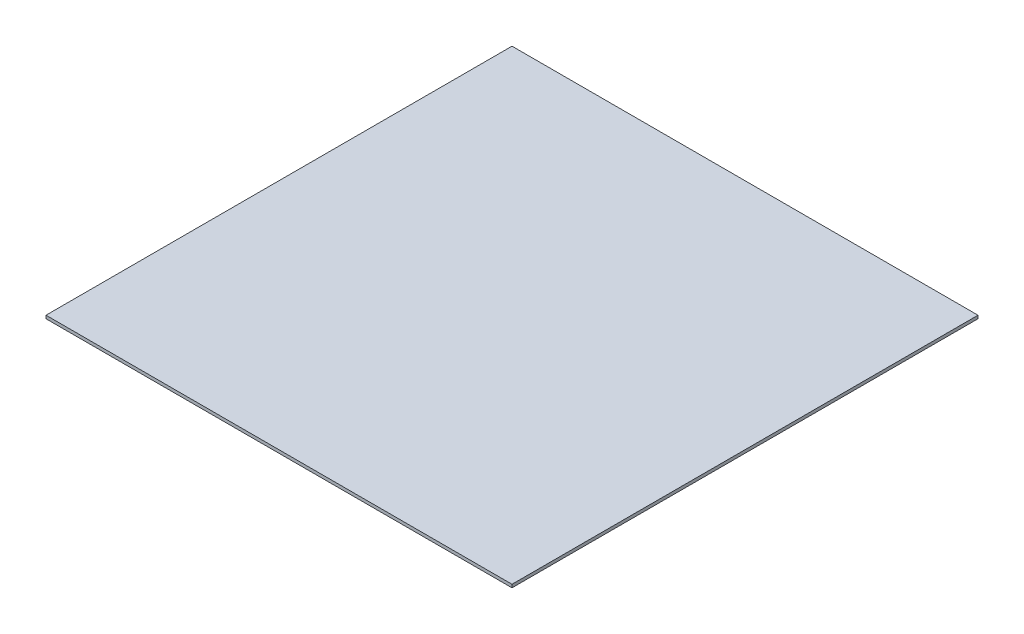
ISO-10303-21;
HEADER;
FILE_DESCRIPTION(('STEP AP214'),'2;1');
FILE_NAME('part.step','',(''),(''),'','','');
FILE_SCHEMA(('AUTOMOTIVE_DESIGN { 1 0 10303 214 1 1 1 1 }'));
ENDSEC;
DATA;
#1=APPLICATION_CONTEXT('core data for automotive mechanical design processes');
#2=APPLICATION_PROTOCOL_DEFINITION('international standard','automotive_design',2000,#1);
#3=PRODUCT_CONTEXT('',#1,'mechanical');
#4=PRODUCT('Part','Part','',(#3));
#5=PRODUCT_RELATED_PRODUCT_CATEGORY('part','',(#4));
#6=PRODUCT_DEFINITION_FORMATION('','',#4);
#7=PRODUCT_DEFINITION_CONTEXT('part definition',#1,'design');
#8=PRODUCT_DEFINITION('design','',#6,#7);
#9=PRODUCT_DEFINITION_SHAPE('','',#8);
#10=(LENGTH_UNIT() NAMED_UNIT(*) SI_UNIT(.MILLI.,.METRE.));
#11=(NAMED_UNIT(*) PLANE_ANGLE_UNIT() SI_UNIT($,.RADIAN.));
#12=(NAMED_UNIT(*) SI_UNIT($,.STERADIAN.) SOLID_ANGLE_UNIT());
#13=UNCERTAINTY_MEASURE_WITH_UNIT(LENGTH_MEASURE(1.E-05),#10,'distance_accuracy_value','');
#14=(GEOMETRIC_REPRESENTATION_CONTEXT(3) GLOBAL_UNCERTAINTY_ASSIGNED_CONTEXT((#13)) GLOBAL_UNIT_ASSIGNED_CONTEXT((#10,
#11,#12)) REPRESENTATION_CONTEXT('',''));
#15=CARTESIAN_POINT('',(0.,0.,0.));
#16=DIRECTION('',(0.,0.,1.));
#17=DIRECTION('',(1.,0.,0.));
#18=AXIS2_PLACEMENT_3D('',#15,#16,#17);
#19=CARTESIAN_POINT('',(82.4597772593405,93.4113284966472,-318.327900011641));
#20=DIRECTION('',(1.,0.,0.));
#21=DIRECTION('',(0.,0.,-1.));
#22=AXIS2_PLACEMENT_3D('',#19,#20,#21);
#23=PLANE('',#22);
#24=DIRECTION('',(0.,0.,1.));
#25=VECTOR('',#24,1.);
#26=CARTESIAN_POINT('',(82.4597772593405,92.4113284966472,-318.327900011641));
#27=LINE('',#26,#25);
#28=CARTESIAN_POINT('',(82.4597772593405,92.4113284966472,-318.327900011641));
#29=VERTEX_POINT('',#28);
#30=CARTESIAN_POINT('',(82.4597772593405,92.4113284966472,-168.327900011641));
#31=VERTEX_POINT('',#30);
#32=EDGE_CURVE('E96',#29,#31,#27,.T.);
#33=ORIENTED_EDGE('',*,*,#32,.T.);
#34=DIRECTION('',(0.,-1.,0.));
#35=VECTOR('',#34,1.);
#36=CARTESIAN_POINT('',(82.4597772593405,93.4113284966472,-168.327900011641));
#37=LINE('',#36,#35);
#38=CARTESIAN_POINT('',(82.4597772593405,93.4113284966472,-168.327900011641));
#39=VERTEX_POINT('',#38);
#40=EDGE_CURVE('E11',#39,#31,#37,.T.);
#41=ORIENTED_EDGE('',*,*,#40,.F.);
#42=DIRECTION('',(0.,0.,1.));
#43=VECTOR('',#42,1.);
#44=CARTESIAN_POINT('',(82.4597772593405,93.4113284966472,-318.327900011641));
#45=LINE('',#44,#43);
#46=CARTESIAN_POINT('',(82.4597772593405,93.4113284966472,-318.327900011641));
#47=VERTEX_POINT('',#46);
#48=EDGE_CURVE('E84',#47,#39,#45,.T.);
#49=ORIENTED_EDGE('',*,*,#48,.F.);
#50=DIRECTION('',(0.,-1.,0.));
#51=VECTOR('',#50,1.);
#52=CARTESIAN_POINT('',(82.4597772593405,93.4113284966472,-318.327900011641));
#53=LINE('',#52,#51);
#54=EDGE_CURVE('E92',#47,#29,#53,.T.);
#55=ORIENTED_EDGE('',*,*,#54,.T.);
#56=EDGE_LOOP('',(#33,#41,#49,#55));
#57=FACE_BOUND('',#56,.T.);
#58=ADVANCED_FACE('F33',(#57),#23,.F.);
#59=CARTESIAN_POINT('',(82.4597772593405,93.4113284966472,-168.327900011641));
#60=DIRECTION('',(0.,0.,-1.));
#61=DIRECTION('',(-1.,0.,0.));
#62=AXIS2_PLACEMENT_3D('',#59,#60,#61);
#63=PLANE('',#62);
#64=DIRECTION('',(1.,0.,0.));
#65=VECTOR('',#64,1.);
#66=CARTESIAN_POINT('',(82.4597772593405,92.4113284966472,-168.327900011641));
#67=LINE('',#66,#65);
#68=CARTESIAN_POINT('',(232.459777259341,92.4113284966472,-168.327900011641));
#69=VERTEX_POINT('',#68);
#70=EDGE_CURVE('E88',#31,#69,#67,.T.);
#71=ORIENTED_EDGE('',*,*,#70,.T.);
#72=DIRECTION('',(0.,-1.,0.));
#73=VECTOR('',#72,1.);
#74=CARTESIAN_POINT('',(232.459777259341,93.4113284966472,-168.327900011641));
#75=LINE('',#74,#73);
#76=CARTESIAN_POINT('',(232.459777259341,93.4113284966472,-168.327900011641));
#77=VERTEX_POINT('',#76);
#78=EDGE_CURVE('E41',#77,#69,#75,.T.);
#79=ORIENTED_EDGE('',*,*,#78,.F.);
#80=DIRECTION('',(1.,0.,0.));
#81=VECTOR('',#80,1.);
#82=CARTESIAN_POINT('',(82.4597772593405,93.4113284966472,-168.327900011641));
#83=LINE('',#82,#81);
#84=EDGE_CURVE('E79',#39,#77,#83,.T.);
#85=ORIENTED_EDGE('',*,*,#84,.F.);
#86=ORIENTED_EDGE('',*,*,#40,.T.);
#87=EDGE_LOOP('',(#71,#79,#85,#86));
#88=FACE_BOUND('',#87,.T.);
#89=ADVANCED_FACE('F87',(#88),#63,.F.);
#90=CARTESIAN_POINT('',(232.459777259341,93.4113284966472,-318.327900011641));
#91=DIRECTION('',(-1.,0.,0.));
#92=DIRECTION('',(0.,0.,1.));
#93=AXIS2_PLACEMENT_3D('',#90,#91,#92);
#94=PLANE('',#93);
#95=DIRECTION('',(0.,0.,-1.));
#96=VECTOR('',#95,1.);
#97=CARTESIAN_POINT('',(232.459777259341,92.4113284966472,-318.327900011641));
#98=LINE('',#97,#96);
#99=CARTESIAN_POINT('',(232.459777259341,92.4113284966472,-318.327900011641));
#100=VERTEX_POINT('',#99);
#101=EDGE_CURVE('E66',#69,#100,#98,.T.);
#102=ORIENTED_EDGE('',*,*,#101,.T.);
#103=DIRECTION('',(0.,-1.,0.));
#104=VECTOR('',#103,1.);
#105=CARTESIAN_POINT('',(232.459777259341,93.4113284966472,-318.327900011641));
#106=LINE('',#105,#104);
#107=CARTESIAN_POINT('',(232.459777259341,93.4113284966472,-318.327900011641));
#108=VERTEX_POINT('',#107);
#109=EDGE_CURVE('E89',#108,#100,#106,.T.);
#110=ORIENTED_EDGE('',*,*,#109,.F.);
#111=DIRECTION('',(0.,0.,-1.));
#112=VECTOR('',#111,1.);
#113=CARTESIAN_POINT('',(232.459777259341,93.4113284966472,-318.327900011641));
#114=LINE('',#113,#112);
#115=EDGE_CURVE('E82',#77,#108,#114,.T.);
#116=ORIENTED_EDGE('',*,*,#115,.F.);
#117=ORIENTED_EDGE('',*,*,#78,.T.);
#118=EDGE_LOOP('',(#102,#110,#116,#117));
#119=FACE_BOUND('',#118,.T.);
#120=ADVANCED_FACE('F90',(#119),#94,.F.);
#121=CARTESIAN_POINT('',(82.4597772593405,93.4113284966472,-318.327900011641));
#122=DIRECTION('',(0.,0.,1.));
#123=DIRECTION('',(1.,0.,0.));
#124=AXIS2_PLACEMENT_3D('',#121,#122,#123);
#125=PLANE('',#124);
#126=DIRECTION('',(-1.,0.,0.));
#127=VECTOR('',#126,1.);
#128=CARTESIAN_POINT('',(82.4597772593405,92.4113284966472,-318.327900011641));
#129=LINE('',#128,#127);
#130=EDGE_CURVE('E72',#100,#29,#129,.T.);
#131=ORIENTED_EDGE('',*,*,#130,.T.);
#132=ORIENTED_EDGE('',*,*,#54,.F.);
#133=DIRECTION('',(-1.,0.,0.));
#134=VECTOR('',#133,1.);
#135=CARTESIAN_POINT('',(82.4597772593405,93.4113284966472,-318.327900011641));
#136=LINE('',#135,#134);
#137=EDGE_CURVE('E49',#108,#47,#136,.T.);
#138=ORIENTED_EDGE('',*,*,#137,.F.);
#139=ORIENTED_EDGE('',*,*,#109,.T.);
#140=EDGE_LOOP('',(#131,#132,#138,#139));
#141=FACE_BOUND('',#140,.T.);
#142=ADVANCED_FACE('F103',(#141),#125,.F.);
#143=CARTESIAN_POINT('',(0.,93.4113284966472,0.));
#144=DIRECTION('',(0.,1.,0.));
#145=DIRECTION('',(0.,0.,1.));
#146=AXIS2_PLACEMENT_3D('',#143,#144,#145);
#147=PLANE('',#146);
#148=ORIENTED_EDGE('',*,*,#48,.T.);
#149=ORIENTED_EDGE('',*,*,#84,.T.);
#150=ORIENTED_EDGE('',*,*,#115,.T.);
#151=ORIENTED_EDGE('',*,*,#137,.T.);
#152=EDGE_LOOP('',(#148,#149,#150,#151));
#153=FACE_BOUND('',#152,.T.);
#154=ADVANCED_FACE('F80',(#153),#147,.T.);
#155=CARTESIAN_POINT('',(0.,92.4113284966472,0.));
#156=DIRECTION('',(0.,1.,0.));
#157=DIRECTION('',(0.,0.,1.));
#158=AXIS2_PLACEMENT_3D('',#155,#156,#157);
#159=PLANE('',#158);
#160=ORIENTED_EDGE('',*,*,#32,.F.);
#161=ORIENTED_EDGE('',*,*,#130,.F.);
#162=ORIENTED_EDGE('',*,*,#101,.F.);
#163=ORIENTED_EDGE('',*,*,#70,.F.);
#164=EDGE_LOOP('',(#160,#161,#162,#163));
#165=FACE_BOUND('',#164,.T.);
#166=ADVANCED_FACE('F106',(#165),#159,.F.);
#167=CLOSED_SHELL('',(#58,#89,#120,#142,#154,#166));
#168=MANIFOLD_SOLID_BREP('B2',#167);
#169=ADVANCED_BREP_SHAPE_REPRESENTATION('',(#18,#168),#14);
#170=SHAPE_DEFINITION_REPRESENTATION(#9,#169);
ENDSEC;
END-ISO-10303-21;
